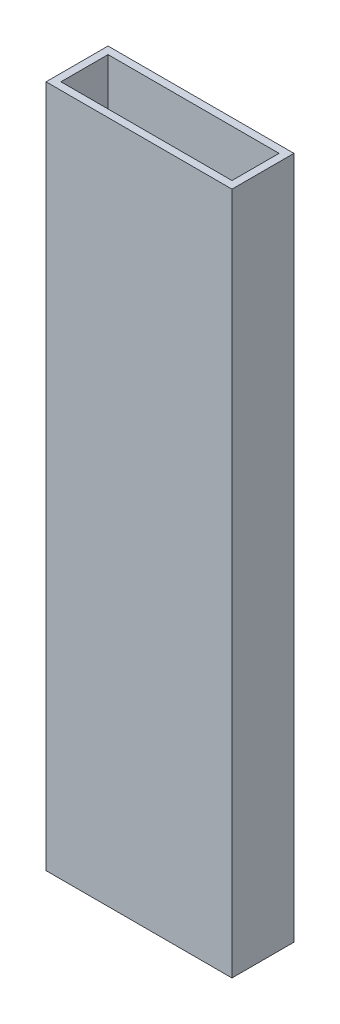
ISO-10303-21;
HEADER;
FILE_DESCRIPTION(('STEP AP214'),'2;1');
FILE_NAME('part.step','',(''),(''),'','','');
FILE_SCHEMA(('AUTOMOTIVE_DESIGN { 1 0 10303 214 1 1 1 1 }'));
ENDSEC;
DATA;
#1=APPLICATION_CONTEXT('core data for automotive mechanical design processes');
#2=APPLICATION_PROTOCOL_DEFINITION('international standard','automotive_design',2000,#1);
#3=PRODUCT_CONTEXT('',#1,'mechanical');
#4=PRODUCT('Part','Part','',(#3));
#5=PRODUCT_RELATED_PRODUCT_CATEGORY('part','',(#4));
#6=PRODUCT_DEFINITION_FORMATION('','',#4);
#7=PRODUCT_DEFINITION_CONTEXT('part definition',#1,'design');
#8=PRODUCT_DEFINITION('design','',#6,#7);
#9=PRODUCT_DEFINITION_SHAPE('','',#8);
#10=(LENGTH_UNIT() NAMED_UNIT(*) SI_UNIT(.MILLI.,.METRE.));
#11=(NAMED_UNIT(*) PLANE_ANGLE_UNIT() SI_UNIT($,.RADIAN.));
#12=(NAMED_UNIT(*) SI_UNIT($,.STERADIAN.) SOLID_ANGLE_UNIT());
#13=UNCERTAINTY_MEASURE_WITH_UNIT(LENGTH_MEASURE(1.E-05),#10,'distance_accuracy_value','');
#14=(GEOMETRIC_REPRESENTATION_CONTEXT(3) GLOBAL_UNCERTAINTY_ASSIGNED_CONTEXT((#13)) GLOBAL_UNIT_ASSIGNED_CONTEXT((#10,
#11,#12)) REPRESENTATION_CONTEXT('',''));
#15=CARTESIAN_POINT('',(0.,0.,0.));
#16=DIRECTION('',(0.,0.,1.));
#17=DIRECTION('',(1.,0.,0.));
#18=AXIS2_PLACEMENT_3D('',#15,#16,#17);
#19=CARTESIAN_POINT('',(-38.1,305.4,-12.7));
#20=DIRECTION('',(1.,0.,0.));
#21=DIRECTION('',(0.,0.,-1.));
#22=AXIS2_PLACEMENT_3D('',#19,#20,#21);
#23=PLANE('',#22);
#24=DIRECTION('',(0.,-1.,0.));
#25=VECTOR('',#24,1.);
#26=CARTESIAN_POINT('',(-38.1,305.4,-12.7));
#27=LINE('',#26,#25);
#28=CARTESIAN_POINT('',(-38.1,292.7,-12.7));
#29=VERTEX_POINT('',#28);
#30=CARTESIAN_POINT('',(-38.1,12.7,-12.7));
#31=VERTEX_POINT('',#30);
#32=EDGE_CURVE('E120',#29,#31,#27,.T.);
#33=ORIENTED_EDGE('',*,*,#32,.T.);
#34=DIRECTION('',(0.,0.,1.));
#35=VECTOR('',#34,1.);
#36=CARTESIAN_POINT('',(-38.1000000000001,12.7,-445.402333190097));
#37=LINE('',#36,#35);
#38=CARTESIAN_POINT('',(-38.1000000000001,12.7,12.7));
#39=VERTEX_POINT('',#38);
#40=EDGE_CURVE('E50',#31,#39,#37,.T.);
#41=ORIENTED_EDGE('',*,*,#40,.T.);
#42=DIRECTION('',(0.,-1.,0.));
#43=VECTOR('',#42,1.);
#44=CARTESIAN_POINT('',(-38.1,305.4,12.7));
#45=LINE('',#44,#43);
#46=CARTESIAN_POINT('',(-38.1,292.7,12.7));
#47=VERTEX_POINT('',#46);
#48=EDGE_CURVE('E122',#47,#39,#45,.T.);
#49=ORIENTED_EDGE('',*,*,#48,.F.);
#50=DIRECTION('',(0.,0.,-1.));
#51=VECTOR('',#50,1.);
#52=CARTESIAN_POINT('',(-38.1,292.7,38.1));
#53=LINE('',#52,#51);
#54=EDGE_CURVE('E169',#47,#29,#53,.T.);
#55=ORIENTED_EDGE('',*,*,#54,.T.);
#56=EDGE_LOOP('',(#33,#41,#49,#55));
#57=FACE_BOUND('',#56,.T.);
#58=ADVANCED_FACE('F36',(#57),#23,.F.);
#59=CARTESIAN_POINT('',(-38.1,305.4,12.7));
#60=DIRECTION('',(0.,0.,-1.));
#61=DIRECTION('',(-1.,0.,0.));
#62=AXIS2_PLACEMENT_3D('',#59,#60,#61);
#63=PLANE('',#62);
#64=ORIENTED_EDGE('',*,*,#48,.T.);
#65=DIRECTION('',(1.,0.,0.));
#66=VECTOR('',#65,1.);
#67=CARTESIAN_POINT('',(-38.0999999999999,12.7,12.7));
#68=LINE('',#67,#66);
#69=CARTESIAN_POINT('',(38.0999999999999,12.7,12.7));
#70=VERTEX_POINT('',#69);
#71=EDGE_CURVE('E105',#39,#70,#68,.T.);
#72=ORIENTED_EDGE('',*,*,#71,.T.);
#73=DIRECTION('',(0.,-1.,0.));
#74=VECTOR('',#73,1.);
#75=CARTESIAN_POINT('',(38.1,305.4,12.7));
#76=LINE('',#75,#74);
#77=CARTESIAN_POINT('',(38.1,292.7,12.7));
#78=VERTEX_POINT('',#77);
#79=EDGE_CURVE('E115',#78,#70,#76,.T.);
#80=ORIENTED_EDGE('',*,*,#79,.F.);
#81=DIRECTION('',(1.,0.,0.));
#82=VECTOR('',#81,1.);
#83=CARTESIAN_POINT('',(-38.1,292.7,12.7));
#84=LINE('',#83,#82);
#85=EDGE_CURVE('E147',#47,#78,#84,.T.);
#86=ORIENTED_EDGE('',*,*,#85,.F.);
#87=EDGE_LOOP('',(#64,#72,#80,#86));
#88=FACE_BOUND('',#87,.T.);
#89=ADVANCED_FACE('F181',(#88),#63,.F.);
#90=CARTESIAN_POINT('',(38.1,305.4,-12.7));
#91=DIRECTION('',(-1.,0.,0.));
#92=DIRECTION('',(0.,0.,1.));
#93=AXIS2_PLACEMENT_3D('',#90,#91,#92);
#94=PLANE('',#93);
#95=ORIENTED_EDGE('',*,*,#79,.T.);
#96=DIRECTION('',(0.,0.,1.));
#97=VECTOR('',#96,1.);
#98=CARTESIAN_POINT('',(38.0999999999999,12.7,-445.402333190097));
#99=LINE('',#98,#97);
#100=CARTESIAN_POINT('',(38.0999999999999,12.7,-12.7));
#101=VERTEX_POINT('',#100);
#102=EDGE_CURVE('E99',#101,#70,#99,.T.);
#103=ORIENTED_EDGE('',*,*,#102,.F.);
#104=DIRECTION('',(0.,-1.,0.));
#105=VECTOR('',#104,1.);
#106=CARTESIAN_POINT('',(38.1,305.4,-12.7));
#107=LINE('',#106,#105);
#108=CARTESIAN_POINT('',(38.1,292.7,-12.7));
#109=VERTEX_POINT('',#108);
#110=EDGE_CURVE('E113',#109,#101,#107,.T.);
#111=ORIENTED_EDGE('',*,*,#110,.F.);
#112=DIRECTION('',(0.,0.,-1.));
#113=VECTOR('',#112,1.);
#114=CARTESIAN_POINT('',(38.1,292.7,38.1));
#115=LINE('',#114,#113);
#116=EDGE_CURVE('E167',#78,#109,#115,.T.);
#117=ORIENTED_EDGE('',*,*,#116,.F.);
#118=EDGE_LOOP('',(#95,#103,#111,#117));
#119=FACE_BOUND('',#118,.T.);
#120=ADVANCED_FACE('F111',(#119),#94,.F.);
#121=CARTESIAN_POINT('',(-38.1,305.4,-12.7));
#122=DIRECTION('',(0.,0.,1.));
#123=DIRECTION('',(1.,0.,0.));
#124=AXIS2_PLACEMENT_3D('',#121,#122,#123);
#125=PLANE('',#124);
#126=ORIENTED_EDGE('',*,*,#110,.T.);
#127=DIRECTION('',(-1.,0.,0.));
#128=VECTOR('',#127,1.);
#129=CARTESIAN_POINT('',(-38.0999999999999,12.7,-12.7));
#130=LINE('',#129,#128);
#131=EDGE_CURVE('E96',#101,#31,#130,.T.);
#132=ORIENTED_EDGE('',*,*,#131,.T.);
#133=ORIENTED_EDGE('',*,*,#32,.F.);
#134=DIRECTION('',(-1.,0.,0.));
#135=VECTOR('',#134,1.);
#136=CARTESIAN_POINT('',(-38.1,292.7,-12.7));
#137=LINE('',#136,#135);
#138=EDGE_CURVE('E119',#109,#29,#137,.T.);
#139=ORIENTED_EDGE('',*,*,#138,.F.);
#140=EDGE_LOOP('',(#126,#132,#133,#139));
#141=FACE_BOUND('',#140,.T.);
#142=ADVANCED_FACE('F118',(#141),#125,.F.);
#143=CARTESIAN_POINT('',(-35.052,305.4,-9.65199999999999));
#144=DIRECTION('',(1.,0.,0.));
#145=DIRECTION('',(0.,0.,-1.));
#146=AXIS2_PLACEMENT_3D('',#143,#144,#145);
#147=PLANE('',#146);
#148=DIRECTION('',(0.,0.,1.));
#149=VECTOR('',#148,1.);
#150=CARTESIAN_POINT('',(-35.052,12.7,-9.65199999999999));
#151=LINE('',#150,#149);
#152=CARTESIAN_POINT('',(-35.052,12.7,-9.65199999999999));
#153=VERTEX_POINT('',#152);
#154=CARTESIAN_POINT('',(-35.052,12.7,9.652));
#155=VERTEX_POINT('',#154);
#156=EDGE_CURVE('E106',#153,#155,#151,.T.);
#157=ORIENTED_EDGE('',*,*,#156,.F.);
#158=DIRECTION('',(0.,-1.,0.));
#159=VECTOR('',#158,1.);
#160=CARTESIAN_POINT('',(-35.052,305.4,-9.65199999999999));
#161=LINE('',#160,#159);
#162=CARTESIAN_POINT('',(-35.052,292.7,-9.65199999999999));
#163=VERTEX_POINT('',#162);
#164=EDGE_CURVE('E135',#163,#153,#161,.T.);
#165=ORIENTED_EDGE('',*,*,#164,.F.);
#166=DIRECTION('',(0.,0.,1.));
#167=VECTOR('',#166,1.);
#168=CARTESIAN_POINT('',(-35.052,292.7,-9.65199999999999));
#169=LINE('',#168,#167);
#170=CARTESIAN_POINT('',(-35.052,292.7,9.652));
#171=VERTEX_POINT('',#170);
#172=EDGE_CURVE('E145',#163,#171,#169,.T.);
#173=ORIENTED_EDGE('',*,*,#172,.T.);
#174=DIRECTION('',(0.,-1.,0.));
#175=VECTOR('',#174,1.);
#176=CARTESIAN_POINT('',(-35.052,305.4,9.652));
#177=LINE('',#176,#175);
#178=EDGE_CURVE('E124',#171,#155,#177,.T.);
#179=ORIENTED_EDGE('',*,*,#178,.T.);
#180=EDGE_LOOP('',(#157,#165,#173,#179));
#181=FACE_BOUND('',#180,.T.);
#182=ADVANCED_FACE('F143',(#181),#147,.T.);
#183=CARTESIAN_POINT('',(-35.052,305.4,9.652));
#184=DIRECTION('',(0.,0.,-1.));
#185=DIRECTION('',(-1.,0.,0.));
#186=AXIS2_PLACEMENT_3D('',#183,#184,#185);
#187=PLANE('',#186);
#188=DIRECTION('',(1.,0.,0.));
#189=VECTOR('',#188,1.);
#190=CARTESIAN_POINT('',(-35.0519999999999,12.7,9.652));
#191=LINE('',#190,#189);
#192=CARTESIAN_POINT('',(35.052,12.7,9.65199999999999));
#193=VERTEX_POINT('',#192);
#194=EDGE_CURVE('E161',#155,#193,#191,.T.);
#195=ORIENTED_EDGE('',*,*,#194,.F.);
#196=ORIENTED_EDGE('',*,*,#178,.F.);
#197=DIRECTION('',(1.,0.,0.));
#198=VECTOR('',#197,1.);
#199=CARTESIAN_POINT('',(-35.052,292.7,9.652));
#200=LINE('',#199,#198);
#201=CARTESIAN_POINT('',(35.052,292.7,9.65199999999999));
#202=VERTEX_POINT('',#201);
#203=EDGE_CURVE('E159',#171,#202,#200,.T.);
#204=ORIENTED_EDGE('',*,*,#203,.T.);
#205=DIRECTION('',(0.,-1.,0.));
#206=VECTOR('',#205,1.);
#207=CARTESIAN_POINT('',(35.052,305.4,9.65199999999999));
#208=LINE('',#207,#206);
#209=EDGE_CURVE('E149',#202,#193,#208,.T.);
#210=ORIENTED_EDGE('',*,*,#209,.T.);
#211=EDGE_LOOP('',(#195,#196,#204,#210));
#212=FACE_BOUND('',#211,.T.);
#213=ADVANCED_FACE('F158',(#212),#187,.T.);
#214=CARTESIAN_POINT('',(35.052,305.4,-9.652));
#215=DIRECTION('',(-1.,0.,0.));
#216=DIRECTION('',(0.,0.,1.));
#217=AXIS2_PLACEMENT_3D('',#214,#215,#216);
#218=PLANE('',#217);
#219=DIRECTION('',(0.,0.,-1.));
#220=VECTOR('',#219,1.);
#221=CARTESIAN_POINT('',(35.052,12.7,-9.652));
#222=LINE('',#221,#220);
#223=CARTESIAN_POINT('',(35.052,12.7,-9.652));
#224=VERTEX_POINT('',#223);
#225=EDGE_CURVE('E57',#193,#224,#222,.T.);
#226=ORIENTED_EDGE('',*,*,#225,.F.);
#227=ORIENTED_EDGE('',*,*,#209,.F.);
#228=DIRECTION('',(0.,0.,-1.));
#229=VECTOR('',#228,1.);
#230=CARTESIAN_POINT('',(35.052,292.7,-9.652));
#231=LINE('',#230,#229);
#232=CARTESIAN_POINT('',(35.052,292.7,-9.652));
#233=VERTEX_POINT('',#232);
#234=EDGE_CURVE('E172',#202,#233,#231,.T.);
#235=ORIENTED_EDGE('',*,*,#234,.T.);
#236=DIRECTION('',(0.,-1.,0.));
#237=VECTOR('',#236,1.);
#238=CARTESIAN_POINT('',(35.052,305.4,-9.652));
#239=LINE('',#238,#237);
#240=EDGE_CURVE('E137',#233,#224,#239,.T.);
#241=ORIENTED_EDGE('',*,*,#240,.T.);
#242=EDGE_LOOP('',(#226,#227,#235,#241));
#243=FACE_BOUND('',#242,.T.);
#244=ADVANCED_FACE('F195',(#243),#218,.T.);
#245=CARTESIAN_POINT('',(-35.052,305.4,-9.65199999999999));
#246=DIRECTION('',(0.,0.,1.));
#247=DIRECTION('',(1.,0.,0.));
#248=AXIS2_PLACEMENT_3D('',#245,#246,#247);
#249=PLANE('',#248);
#250=DIRECTION('',(-1.,0.,0.));
#251=VECTOR('',#250,1.);
#252=CARTESIAN_POINT('',(-35.0519999999999,12.7,-9.65199999999999));
#253=LINE('',#252,#251);
#254=EDGE_CURVE('E11',#224,#153,#253,.T.);
#255=ORIENTED_EDGE('',*,*,#254,.F.);
#256=ORIENTED_EDGE('',*,*,#240,.F.);
#257=DIRECTION('',(-1.,0.,0.));
#258=VECTOR('',#257,1.);
#259=CARTESIAN_POINT('',(-35.052,292.7,-9.65199999999999));
#260=LINE('',#259,#258);
#261=EDGE_CURVE('E43',#233,#163,#260,.T.);
#262=ORIENTED_EDGE('',*,*,#261,.T.);
#263=ORIENTED_EDGE('',*,*,#164,.T.);
#264=EDGE_LOOP('',(#255,#256,#262,#263));
#265=FACE_BOUND('',#264,.T.);
#266=ADVANCED_FACE('F134',(#265),#249,.T.);
#267=CARTESIAN_POINT('',(-38.1,292.7,38.1));
#268=DIRECTION('',(0.,1.,0.));
#269=DIRECTION('',(0.,0.,1.));
#270=AXIS2_PLACEMENT_3D('',#267,#268,#269);
#271=PLANE('',#270);
#272=ORIENTED_EDGE('',*,*,#261,.F.);
#273=ORIENTED_EDGE('',*,*,#234,.F.);
#274=ORIENTED_EDGE('',*,*,#203,.F.);
#275=ORIENTED_EDGE('',*,*,#172,.F.);
#276=EDGE_LOOP('',(#272,#273,#274,#275));
#277=FACE_BOUND('',#276,.T.);
#278=ORIENTED_EDGE('',*,*,#85,.T.);
#279=ORIENTED_EDGE('',*,*,#116,.T.);
#280=ORIENTED_EDGE('',*,*,#138,.T.);
#281=ORIENTED_EDGE('',*,*,#54,.F.);
#282=EDGE_LOOP('',(#278,#279,#280,#281));
#283=FACE_BOUND('',#282,.T.);
#284=ADVANCED_FACE('F176',(#277,#283),#271,.T.);
#285=CARTESIAN_POINT('',(-38.1000000000001,12.7,-445.402333190097));
#286=DIRECTION('',(0.,1.,0.));
#287=DIRECTION('',(-1.,0.,0.));
#288=AXIS2_PLACEMENT_3D('',#285,#286,#287);
#289=PLANE('',#288);
#290=ORIENTED_EDGE('',*,*,#156,.T.);
#291=ORIENTED_EDGE('',*,*,#194,.T.);
#292=ORIENTED_EDGE('',*,*,#225,.T.);
#293=ORIENTED_EDGE('',*,*,#254,.T.);
#294=EDGE_LOOP('',(#290,#291,#292,#293));
#295=FACE_BOUND('',#294,.T.);
#296=ORIENTED_EDGE('',*,*,#40,.F.);
#297=ORIENTED_EDGE('',*,*,#131,.F.);
#298=ORIENTED_EDGE('',*,*,#102,.T.);
#299=ORIENTED_EDGE('',*,*,#71,.F.);
#300=EDGE_LOOP('',(#296,#297,#298,#299));
#301=FACE_BOUND('',#300,.T.);
#302=ADVANCED_FACE('F98',(#295,#301),#289,.F.);
#303=CLOSED_SHELL('',(#58,#89,#120,#142,#182,#213,#244,#266,#284,#302));
#304=MANIFOLD_SOLID_BREP('B2',#303);
#305=ADVANCED_BREP_SHAPE_REPRESENTATION('',(#18,#304),#14);
#306=SHAPE_DEFINITION_REPRESENTATION(#9,#305);
ENDSEC;
END-ISO-10303-21;
